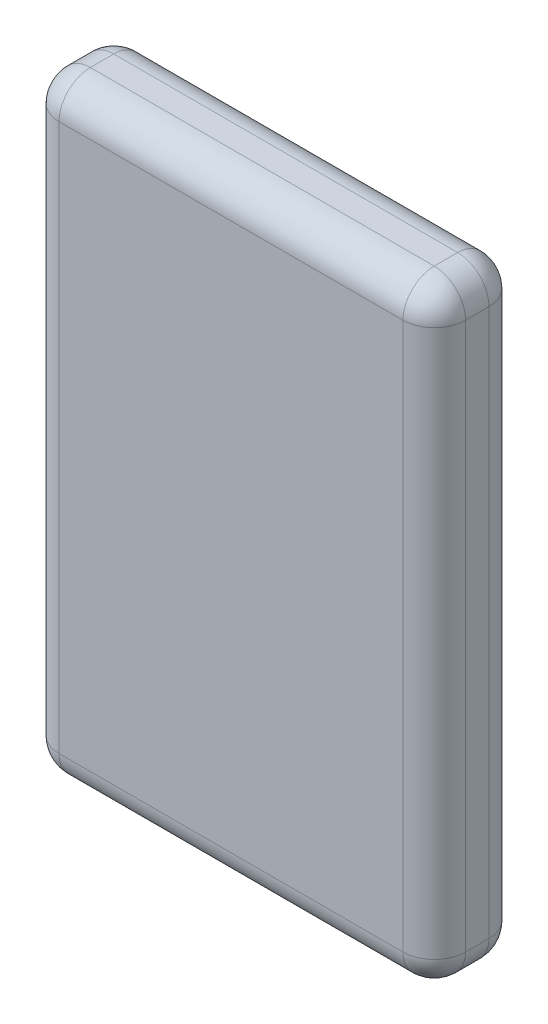
ISO-10303-21;
HEADER;
FILE_DESCRIPTION(('STEP AP214'),'2;1');
FILE_NAME('part.step','',(''),(''),'','','');
FILE_SCHEMA(('AUTOMOTIVE_DESIGN { 1 0 10303 214 1 1 1 1 }'));
ENDSEC;
DATA;
#1=APPLICATION_CONTEXT('core data for automotive mechanical design processes');
#2=APPLICATION_PROTOCOL_DEFINITION('international standard','automotive_design',2000,#1);
#3=PRODUCT_CONTEXT('',#1,'mechanical');
#4=PRODUCT('Part','Part','',(#3));
#5=PRODUCT_RELATED_PRODUCT_CATEGORY('part','',(#4));
#6=PRODUCT_DEFINITION_FORMATION('','',#4);
#7=PRODUCT_DEFINITION_CONTEXT('part definition',#1,'design');
#8=PRODUCT_DEFINITION('design','',#6,#7);
#9=PRODUCT_DEFINITION_SHAPE('','',#8);
#10=(LENGTH_UNIT() NAMED_UNIT(*) SI_UNIT(.MILLI.,.METRE.));
#11=(NAMED_UNIT(*) PLANE_ANGLE_UNIT() SI_UNIT($,.RADIAN.));
#12=(NAMED_UNIT(*) SI_UNIT($,.STERADIAN.) SOLID_ANGLE_UNIT());
#13=UNCERTAINTY_MEASURE_WITH_UNIT(LENGTH_MEASURE(1.E-05),#10,'distance_accuracy_value','');
#14=(GEOMETRIC_REPRESENTATION_CONTEXT(3) GLOBAL_UNCERTAINTY_ASSIGNED_CONTEXT((#13)) GLOBAL_UNIT_ASSIGNED_CONTEXT((#10,
#11,#12)) REPRESENTATION_CONTEXT('',''));
#15=CARTESIAN_POINT('',(0.,0.,0.));
#16=DIRECTION('',(0.,0.,1.));
#17=DIRECTION('',(1.,0.,0.));
#18=AXIS2_PLACEMENT_3D('',#15,#16,#17);
#19=CARTESIAN_POINT('',(13.,21.7257836954812,7.7));
#20=DIRECTION('',(-1.,0.,0.));
#21=DIRECTION('',(0.,-1.,0.));
#22=AXIS2_PLACEMENT_3D('',#19,#20,#21);
#23=PLANE('',#22);
#24=DIRECTION('',(0.,1.,0.));
#25=VECTOR('',#24,1.);
#26=CARTESIAN_POINT('',(13.,-17.2742163045188,5.7));
#27=LINE('',#26,#25);
#28=CARTESIAN_POINT('',(13.,19.7257836954812,5.7));
#29=VERTEX_POINT('',#28);
#30=CARTESIAN_POINT('',(13.,-15.2742163045188,5.7));
#31=VERTEX_POINT('',#30);
#32=EDGE_CURVE('E152',#29,#31,#27,.F.);
#33=ORIENTED_EDGE('',*,*,#32,.T.);
#34=DIRECTION('',(0.,0.,-1.));
#35=VECTOR('',#34,1.);
#36=CARTESIAN_POINT('',(13.,-15.2742163045188,7.7));
#37=LINE('',#36,#35);
#38=CARTESIAN_POINT('',(13.,-15.2742163045188,4.2));
#39=VERTEX_POINT('',#38);
#40=EDGE_CURVE('E126',#31,#39,#37,.T.);
#41=ORIENTED_EDGE('',*,*,#40,.T.);
#42=DIRECTION('',(0.,1.,0.));
#43=VECTOR('',#42,1.);
#44=CARTESIAN_POINT('',(13.,21.7257836954812,4.2));
#45=LINE('',#44,#43);
#46=CARTESIAN_POINT('',(13.,19.7257836954812,4.2));
#47=VERTEX_POINT('',#46);
#48=EDGE_CURVE('E143',#39,#47,#45,.T.);
#49=ORIENTED_EDGE('',*,*,#48,.T.);
#50=DIRECTION('',(0.,0.,-1.));
#51=VECTOR('',#50,1.);
#52=CARTESIAN_POINT('',(13.,19.7257836954812,7.7));
#53=LINE('',#52,#51);
#54=EDGE_CURVE('E149',#47,#29,#53,.F.);
#55=ORIENTED_EDGE('',*,*,#54,.T.);
#56=EDGE_LOOP('',(#33,#41,#49,#55));
#57=FACE_BOUND('',#56,.T.);
#58=ADVANCED_FACE('F33',(#57),#23,.F.);
#59=CARTESIAN_POINT('',(-13.,21.7257836954812,7.7));
#60=DIRECTION('',(0.,-1.,0.));
#61=DIRECTION('',(0.,0.,-1.));
#62=AXIS2_PLACEMENT_3D('',#59,#60,#61);
#63=PLANE('',#62);
#64=DIRECTION('',(-1.,0.,0.));
#65=VECTOR('',#64,1.);
#66=CARTESIAN_POINT('',(13.,21.7257836954812,5.7));
#67=LINE('',#66,#65);
#68=CARTESIAN_POINT('',(-11.,21.7257836954812,5.7));
#69=VERTEX_POINT('',#68);
#70=CARTESIAN_POINT('',(11.,21.7257836954812,5.7));
#71=VERTEX_POINT('',#70);
#72=EDGE_CURVE('E187',#69,#71,#67,.F.);
#73=ORIENTED_EDGE('',*,*,#72,.T.);
#74=DIRECTION('',(0.,0.,-1.));
#75=VECTOR('',#74,1.);
#76=CARTESIAN_POINT('',(11.,21.7257836954812,7.7));
#77=LINE('',#76,#75);
#78=CARTESIAN_POINT('',(11.,21.7257836954812,4.2));
#79=VERTEX_POINT('',#78);
#80=EDGE_CURVE('E189',#71,#79,#77,.T.);
#81=ORIENTED_EDGE('',*,*,#80,.T.);
#82=DIRECTION('',(-1.,0.,0.));
#83=VECTOR('',#82,1.);
#84=CARTESIAN_POINT('',(-13.,21.7257836954812,4.2));
#85=LINE('',#84,#83);
#86=CARTESIAN_POINT('',(-11.,21.7257836954812,4.2));
#87=VERTEX_POINT('',#86);
#88=EDGE_CURVE('E183',#79,#87,#85,.T.);
#89=ORIENTED_EDGE('',*,*,#88,.T.);
#90=DIRECTION('',(0.,0.,-1.));
#91=VECTOR('',#90,1.);
#92=CARTESIAN_POINT('',(-11.,21.7257836954812,7.7));
#93=LINE('',#92,#91);
#94=EDGE_CURVE('E185',#87,#69,#93,.F.);
#95=ORIENTED_EDGE('',*,*,#94,.T.);
#96=EDGE_LOOP('',(#73,#81,#89,#95));
#97=FACE_BOUND('',#96,.T.);
#98=ADVANCED_FACE('F291',(#97),#63,.F.);
#99=CARTESIAN_POINT('',(-13.,21.7257836954812,7.7));
#100=DIRECTION('',(1.,0.,0.));
#101=DIRECTION('',(0.,1.,0.));
#102=AXIS2_PLACEMENT_3D('',#99,#100,#101);
#103=PLANE('',#102);
#104=DIRECTION('',(0.,0.,-1.));
#105=VECTOR('',#104,1.);
#106=CARTESIAN_POINT('',(-13.,-15.2742163045188,7.7));
#107=LINE('',#106,#105);
#108=CARTESIAN_POINT('',(-13.,-15.2742163045188,4.2));
#109=VERTEX_POINT('',#108);
#110=CARTESIAN_POINT('',(-13.,-15.2742163045188,5.7));
#111=VERTEX_POINT('',#110);
#112=EDGE_CURVE('E178',#109,#111,#107,.F.);
#113=ORIENTED_EDGE('',*,*,#112,.T.);
#114=DIRECTION('',(0.,-1.,0.));
#115=VECTOR('',#114,1.);
#116=CARTESIAN_POINT('',(-13.,21.7257836954812,5.7));
#117=LINE('',#116,#115);
#118=CARTESIAN_POINT('',(-13.,19.7257836954812,5.7));
#119=VERTEX_POINT('',#118);
#120=EDGE_CURVE('E180',#111,#119,#117,.F.);
#121=ORIENTED_EDGE('',*,*,#120,.T.);
#122=DIRECTION('',(0.,0.,-1.));
#123=VECTOR('',#122,1.);
#124=CARTESIAN_POINT('',(-13.,19.7257836954812,7.7));
#125=LINE('',#124,#123);
#126=CARTESIAN_POINT('',(-13.,19.7257836954812,4.2));
#127=VERTEX_POINT('',#126);
#128=EDGE_CURVE('E176',#119,#127,#125,.T.);
#129=ORIENTED_EDGE('',*,*,#128,.T.);
#130=DIRECTION('',(0.,-1.,0.));
#131=VECTOR('',#130,1.);
#132=CARTESIAN_POINT('',(-13.,21.7257836954812,4.2));
#133=LINE('',#132,#131);
#134=EDGE_CURVE('E174',#127,#109,#133,.T.);
#135=ORIENTED_EDGE('',*,*,#134,.T.);
#136=EDGE_LOOP('',(#113,#121,#129,#135));
#137=FACE_BOUND('',#136,.T.);
#138=ADVANCED_FACE('F263',(#137),#103,.F.);
#139=CARTESIAN_POINT('',(-13.,-17.2742163045188,7.7));
#140=DIRECTION('',(0.,1.,0.));
#141=DIRECTION('',(0.,0.,1.));
#142=AXIS2_PLACEMENT_3D('',#139,#140,#141);
#143=PLANE('',#142);
#144=DIRECTION('',(1.,0.,0.));
#145=VECTOR('',#144,1.);
#146=CARTESIAN_POINT('',(-13.,-17.2742163045188,4.2));
#147=LINE('',#146,#145);
#148=CARTESIAN_POINT('',(-11.,-17.2742163045188,4.2));
#149=VERTEX_POINT('',#148);
#150=CARTESIAN_POINT('',(11.,-17.2742163045188,4.2));
#151=VERTEX_POINT('',#150);
#152=EDGE_CURVE('E154',#149,#151,#147,.T.);
#153=ORIENTED_EDGE('',*,*,#152,.T.);
#154=DIRECTION('',(0.,0.,-1.));
#155=VECTOR('',#154,1.);
#156=CARTESIAN_POINT('',(11.,-17.2742163045188,7.7));
#157=LINE('',#156,#155);
#158=CARTESIAN_POINT('',(11.,-17.2742163045188,5.7));
#159=VERTEX_POINT('',#158);
#160=EDGE_CURVE('E128',#151,#159,#157,.F.);
#161=ORIENTED_EDGE('',*,*,#160,.T.);
#162=DIRECTION('',(1.,0.,0.));
#163=VECTOR('',#162,1.);
#164=CARTESIAN_POINT('',(-13.,-17.2742163045188,5.7));
#165=LINE('',#164,#163);
#166=CARTESIAN_POINT('',(-11.,-17.2742163045188,5.7));
#167=VERTEX_POINT('',#166);
#168=EDGE_CURVE('E162',#159,#167,#165,.F.);
#169=ORIENTED_EDGE('',*,*,#168,.T.);
#170=DIRECTION('',(0.,0.,-1.));
#171=VECTOR('',#170,1.);
#172=CARTESIAN_POINT('',(-11.,-17.2742163045188,7.7));
#173=LINE('',#172,#171);
#174=EDGE_CURVE('E156',#167,#149,#173,.T.);
#175=ORIENTED_EDGE('',*,*,#174,.T.);
#176=EDGE_LOOP('',(#153,#161,#169,#175));
#177=FACE_BOUND('',#176,.T.);
#178=ADVANCED_FACE('F314',(#177),#143,.F.);
#179=CARTESIAN_POINT('',(0.,0.,7.7));
#180=DIRECTION('',(0.,0.,1.));
#181=DIRECTION('',(1.,0.,0.));
#182=AXIS2_PLACEMENT_3D('',#179,#180,#181);
#183=PLANE('',#182);
#184=DIRECTION('',(0.,-1.,0.));
#185=VECTOR('',#184,1.);
#186=CARTESIAN_POINT('',(-11.,-17.2742163045188,7.7));
#187=LINE('',#186,#185);
#188=CARTESIAN_POINT('',(-11.,19.7257836954812,7.7));
#189=VERTEX_POINT('',#188);
#190=CARTESIAN_POINT('',(-11.,-15.2742163045188,7.7));
#191=VERTEX_POINT('',#190);
#192=EDGE_CURVE('E167',#189,#191,#187,.T.);
#193=ORIENTED_EDGE('',*,*,#192,.T.);
#194=DIRECTION('',(1.,0.,0.));
#195=VECTOR('',#194,1.);
#196=CARTESIAN_POINT('',(13.,-15.2742163045188,7.7));
#197=LINE('',#196,#195);
#198=CARTESIAN_POINT('',(11.,-15.2742163045188,7.7));
#199=VERTEX_POINT('',#198);
#200=EDGE_CURVE('E171',#191,#199,#197,.T.);
#201=ORIENTED_EDGE('',*,*,#200,.T.);
#202=DIRECTION('',(0.,1.,0.));
#203=VECTOR('',#202,1.);
#204=CARTESIAN_POINT('',(11.,21.7257836954812,7.7));
#205=LINE('',#204,#203);
#206=CARTESIAN_POINT('',(11.,19.7257836954812,7.7));
#207=VERTEX_POINT('',#206);
#208=EDGE_CURVE('E169',#199,#207,#205,.T.);
#209=ORIENTED_EDGE('',*,*,#208,.T.);
#210=DIRECTION('',(-1.,0.,0.));
#211=VECTOR('',#210,1.);
#212=CARTESIAN_POINT('',(-13.,19.7257836954812,7.7));
#213=LINE('',#212,#211);
#214=EDGE_CURVE('E165',#207,#189,#213,.T.);
#215=ORIENTED_EDGE('',*,*,#214,.T.);
#216=EDGE_LOOP('',(#193,#201,#209,#215));
#217=FACE_BOUND('',#216,.T.);
#218=ADVANCED_FACE('F284',(#217),#183,.T.);
#219=CARTESIAN_POINT('',(0.,0.,2.2));
#220=DIRECTION('',(0.,0.,1.));
#221=DIRECTION('',(1.,0.,0.));
#222=AXIS2_PLACEMENT_3D('',#219,#220,#221);
#223=PLANE('',#222);
#224=DIRECTION('',(0.,-1.,0.));
#225=VECTOR('',#224,1.);
#226=CARTESIAN_POINT('',(-11.,0.,2.2));
#227=LINE('',#226,#225);
#228=CARTESIAN_POINT('',(-11.,-15.2742163045188,2.2));
#229=VERTEX_POINT('',#228);
#230=CARTESIAN_POINT('',(-11.,19.7257836954812,2.2));
#231=VERTEX_POINT('',#230);
#232=EDGE_CURVE('E42',#229,#231,#227,.F.);
#233=ORIENTED_EDGE('',*,*,#232,.T.);
#234=DIRECTION('',(-1.,0.,0.));
#235=VECTOR('',#234,1.);
#236=CARTESIAN_POINT('',(0.,19.7257836954812,2.2));
#237=LINE('',#236,#235);
#238=CARTESIAN_POINT('',(11.,19.7257836954812,2.2));
#239=VERTEX_POINT('',#238);
#240=EDGE_CURVE('E11',#231,#239,#237,.F.);
#241=ORIENTED_EDGE('',*,*,#240,.T.);
#242=DIRECTION('',(0.,1.,0.));
#243=VECTOR('',#242,1.);
#244=CARTESIAN_POINT('',(11.,0.,2.2));
#245=LINE('',#244,#243);
#246=CARTESIAN_POINT('',(11.,-15.2742163045188,2.2));
#247=VERTEX_POINT('',#246);
#248=EDGE_CURVE('E192',#239,#247,#245,.F.);
#249=ORIENTED_EDGE('',*,*,#248,.T.);
#250=DIRECTION('',(1.,0.,0.));
#251=VECTOR('',#250,1.);
#252=CARTESIAN_POINT('',(0.,-15.2742163045188,2.2));
#253=LINE('',#252,#251);
#254=EDGE_CURVE('E53',#247,#229,#253,.F.);
#255=ORIENTED_EDGE('',*,*,#254,.T.);
#256=EDGE_LOOP('',(#233,#241,#249,#255));
#257=FACE_BOUND('',#256,.T.);
#258=ADVANCED_FACE('F321',(#257),#223,.F.);
#259=CARTESIAN_POINT('',(-11.,19.7257836954812,7.7));
#260=DIRECTION('',(0.,0.,-1.));
#261=DIRECTION('',(-1.,0.,0.));
#262=AXIS2_PLACEMENT_3D('',#259,#260,#261);
#263=CYLINDRICAL_SURFACE('',#262,2.);
#264=CARTESIAN_POINT('',(-11.,19.7257836954812,5.7));
#265=DIRECTION('',(0.,0.,1.));
#266=DIRECTION('',(1.,0.,0.));
#267=AXIS2_PLACEMENT_3D('',#264,#265,#266);
#268=CIRCLE('',#267,2.);
#269=EDGE_CURVE('E37',#69,#119,#268,.T.);
#270=ORIENTED_EDGE('',*,*,#269,.F.);
#271=ORIENTED_EDGE('',*,*,#94,.F.);
#272=CARTESIAN_POINT('',(-11.,19.7257836954812,4.2));
#273=DIRECTION('',(0.,0.,-1.));
#274=DIRECTION('',(-1.,0.,0.));
#275=AXIS2_PLACEMENT_3D('',#272,#273,#274);
#276=CIRCLE('',#275,2.);
#277=EDGE_CURVE('E244',#127,#87,#276,.T.);
#278=ORIENTED_EDGE('',*,*,#277,.F.);
#279=ORIENTED_EDGE('',*,*,#128,.F.);
#280=EDGE_LOOP('',(#270,#271,#278,#279));
#281=FACE_BOUND('',#280,.T.);
#282=ADVANCED_FACE('F35',(#281),#263,.T.);
#283=CARTESIAN_POINT('',(-11.,19.7257836954812,5.7));
#284=DIRECTION('',(-1.,0.,0.));
#285=DIRECTION('',(0.,0.,1.));
#286=AXIS2_PLACEMENT_3D('',#283,#284,#285);
#287=SPHERICAL_SURFACE('',#286,2.);
#288=CARTESIAN_POINT('',(-11.,19.7257836954812,5.7));
#289=DIRECTION('',(-1.,0.,0.));
#290=DIRECTION('',(0.,0.,1.));
#291=AXIS2_PLACEMENT_3D('',#288,#289,#290);
#292=CIRCLE('',#291,2.);
#293=EDGE_CURVE('E240',#69,#189,#292,.F.);
#294=ORIENTED_EDGE('',*,*,#293,.F.);
#295=ORIENTED_EDGE('',*,*,#269,.T.);
#296=CARTESIAN_POINT('',(-11.,19.7257836954812,5.7));
#297=DIRECTION('',(0.,1.,0.));
#298=DIRECTION('',(0.,0.,1.));
#299=AXIS2_PLACEMENT_3D('',#296,#297,#298);
#300=CIRCLE('',#299,2.);
#301=EDGE_CURVE('E243',#189,#119,#300,.F.);
#302=ORIENTED_EDGE('',*,*,#301,.F.);
#303=EDGE_LOOP('',(#294,#295,#302));
#304=FACE_BOUND('',#303,.T.);
#305=ADVANCED_FACE('F256',(#304),#287,.T.);
#306=CARTESIAN_POINT('',(-11.,19.7257836954812,4.2));
#307=DIRECTION('',(0.,1.,0.));
#308=DIRECTION('',(0.,0.,1.));
#309=AXIS2_PLACEMENT_3D('',#306,#307,#308);
#310=SPHERICAL_SURFACE('',#309,2.);
#311=CARTESIAN_POINT('',(-11.,19.7257836954812,4.2));
#312=DIRECTION('',(0.,1.,0.));
#313=DIRECTION('',(0.,0.,1.));
#314=AXIS2_PLACEMENT_3D('',#311,#312,#313);
#315=CIRCLE('',#314,2.);
#316=EDGE_CURVE('E235',#127,#231,#315,.F.);
#317=ORIENTED_EDGE('',*,*,#316,.F.);
#318=ORIENTED_EDGE('',*,*,#277,.T.);
#319=CARTESIAN_POINT('',(-11.,19.7257836954812,4.2));
#320=DIRECTION('',(-1.,0.,0.));
#321=DIRECTION('',(0.,0.,1.));
#322=AXIS2_PLACEMENT_3D('',#319,#320,#321);
#323=CIRCLE('',#322,2.);
#324=EDGE_CURVE('E237',#231,#87,#323,.F.);
#325=ORIENTED_EDGE('',*,*,#324,.F.);
#326=EDGE_LOOP('',(#317,#318,#325));
#327=FACE_BOUND('',#326,.T.);
#328=ADVANCED_FACE('F303',(#327),#310,.T.);
#329=CARTESIAN_POINT('',(-11.,0.,5.7));
#330=DIRECTION('',(0.,1.,0.));
#331=DIRECTION('',(-1.,0.,0.));
#332=AXIS2_PLACEMENT_3D('',#329,#330,#331);
#333=CYLINDRICAL_SURFACE('',#332,2.);
#334=ORIENTED_EDGE('',*,*,#301,.T.);
#335=ORIENTED_EDGE('',*,*,#120,.F.);
#336=CARTESIAN_POINT('',(-11.,-15.2742163045188,5.7));
#337=DIRECTION('',(0.,-1.,0.));
#338=DIRECTION('',(0.,0.,-1.));
#339=AXIS2_PLACEMENT_3D('',#336,#337,#338);
#340=CIRCLE('',#339,2.);
#341=EDGE_CURVE('E229',#191,#111,#340,.T.);
#342=ORIENTED_EDGE('',*,*,#341,.F.);
#343=ORIENTED_EDGE('',*,*,#192,.F.);
#344=EDGE_LOOP('',(#334,#335,#342,#343));
#345=FACE_BOUND('',#344,.T.);
#346=ADVANCED_FACE('F268',(#345),#333,.T.);
#347=CARTESIAN_POINT('',(0.,19.7257836954812,5.7));
#348=DIRECTION('',(1.,0.,0.));
#349=DIRECTION('',(0.,0.,-1.));
#350=AXIS2_PLACEMENT_3D('',#347,#348,#349);
#351=CYLINDRICAL_SURFACE('',#350,2.);
#352=ORIENTED_EDGE('',*,*,#293,.T.);
#353=ORIENTED_EDGE('',*,*,#214,.F.);
#354=CARTESIAN_POINT('',(11.,19.7257836954812,5.7));
#355=DIRECTION('',(1.,0.,0.));
#356=DIRECTION('',(0.,0.,-1.));
#357=AXIS2_PLACEMENT_3D('',#354,#355,#356);
#358=CIRCLE('',#357,2.);
#359=EDGE_CURVE('E226',#71,#207,#358,.T.);
#360=ORIENTED_EDGE('',*,*,#359,.F.);
#361=ORIENTED_EDGE('',*,*,#72,.F.);
#362=EDGE_LOOP('',(#352,#353,#360,#361));
#363=FACE_BOUND('',#362,.T.);
#364=ADVANCED_FACE('F288',(#363),#351,.T.);
#365=CARTESIAN_POINT('',(11.,19.7257836954812,7.7));
#366=DIRECTION('',(0.,0.,-1.));
#367=DIRECTION('',(-1.,0.,0.));
#368=AXIS2_PLACEMENT_3D('',#365,#366,#367);
#369=CYLINDRICAL_SURFACE('',#368,2.);
#370=CARTESIAN_POINT('',(11.,19.7257836954812,4.2));
#371=DIRECTION('',(0.,0.,-1.));
#372=DIRECTION('',(-1.,0.,0.));
#373=AXIS2_PLACEMENT_3D('',#370,#371,#372);
#374=CIRCLE('',#373,2.);
#375=EDGE_CURVE('E220',#79,#47,#374,.T.);
#376=ORIENTED_EDGE('',*,*,#375,.F.);
#377=ORIENTED_EDGE('',*,*,#80,.F.);
#378=CARTESIAN_POINT('',(11.,19.7257836954812,5.7));
#379=DIRECTION('',(0.,0.,1.));
#380=DIRECTION('',(1.,0.,0.));
#381=AXIS2_PLACEMENT_3D('',#378,#379,#380);
#382=CIRCLE('',#381,2.);
#383=EDGE_CURVE('E223',#29,#71,#382,.T.);
#384=ORIENTED_EDGE('',*,*,#383,.F.);
#385=ORIENTED_EDGE('',*,*,#54,.F.);
#386=EDGE_LOOP('',(#376,#377,#384,#385));
#387=FACE_BOUND('',#386,.T.);
#388=ADVANCED_FACE('F295',(#387),#369,.T.);
#389=CARTESIAN_POINT('',(-13.,19.7257836954812,4.2));
#390=DIRECTION('',(-1.,0.,0.));
#391=DIRECTION('',(0.,0.,1.));
#392=AXIS2_PLACEMENT_3D('',#389,#390,#391);
#393=CYLINDRICAL_SURFACE('',#392,2.);
#394=ORIENTED_EDGE('',*,*,#324,.T.);
#395=ORIENTED_EDGE('',*,*,#88,.F.);
#396=CARTESIAN_POINT('',(11.,19.7257836954812,4.2));
#397=DIRECTION('',(1.,0.,0.));
#398=DIRECTION('',(0.,1.,0.));
#399=AXIS2_PLACEMENT_3D('',#396,#397,#398);
#400=CIRCLE('',#399,2.);
#401=EDGE_CURVE('E218',#239,#79,#400,.T.);
#402=ORIENTED_EDGE('',*,*,#401,.F.);
#403=ORIENTED_EDGE('',*,*,#240,.F.);
#404=EDGE_LOOP('',(#394,#395,#402,#403));
#405=FACE_BOUND('',#404,.T.);
#406=ADVANCED_FACE('F301',(#405),#393,.T.);
#407=CARTESIAN_POINT('',(-11.,21.7257836954812,4.2));
#408=DIRECTION('',(0.,-1.,0.));
#409=DIRECTION('',(1.,0.,0.));
#410=AXIS2_PLACEMENT_3D('',#407,#408,#409);
#411=CYLINDRICAL_SURFACE('',#410,2.);
#412=ORIENTED_EDGE('',*,*,#316,.T.);
#413=ORIENTED_EDGE('',*,*,#232,.F.);
#414=CARTESIAN_POINT('',(-11.,-15.2742163045188,4.2));
#415=DIRECTION('',(0.,-1.,0.));
#416=DIRECTION('',(0.,0.,-1.));
#417=AXIS2_PLACEMENT_3D('',#414,#415,#416);
#418=CIRCLE('',#417,2.);
#419=EDGE_CURVE('E215',#109,#229,#418,.T.);
#420=ORIENTED_EDGE('',*,*,#419,.F.);
#421=ORIENTED_EDGE('',*,*,#134,.F.);
#422=EDGE_LOOP('',(#412,#413,#420,#421));
#423=FACE_BOUND('',#422,.T.);
#424=ADVANCED_FACE('F306',(#423),#411,.T.);
#425=CARTESIAN_POINT('',(-11.,-15.2742163045188,7.7));
#426=DIRECTION('',(0.,0.,-1.));
#427=DIRECTION('',(-1.,0.,0.));
#428=AXIS2_PLACEMENT_3D('',#425,#426,#427);
#429=CYLINDRICAL_SURFACE('',#428,2.);
#430=CARTESIAN_POINT('',(-11.,-15.2742163045188,5.7));
#431=DIRECTION('',(0.,0.,1.));
#432=DIRECTION('',(1.,0.,0.));
#433=AXIS2_PLACEMENT_3D('',#430,#431,#432);
#434=CIRCLE('',#433,2.);
#435=EDGE_CURVE('E232',#111,#167,#434,.T.);
#436=ORIENTED_EDGE('',*,*,#435,.F.);
#437=ORIENTED_EDGE('',*,*,#112,.F.);
#438=CARTESIAN_POINT('',(-11.,-15.2742163045188,4.2));
#439=DIRECTION('',(0.,0.,-1.));
#440=DIRECTION('',(-1.,0.,0.));
#441=AXIS2_PLACEMENT_3D('',#438,#439,#440);
#442=CIRCLE('',#441,2.);
#443=EDGE_CURVE('E212',#149,#109,#442,.T.);
#444=ORIENTED_EDGE('',*,*,#443,.F.);
#445=ORIENTED_EDGE('',*,*,#174,.F.);
#446=EDGE_LOOP('',(#436,#437,#444,#445));
#447=FACE_BOUND('',#446,.T.);
#448=ADVANCED_FACE('F272',(#447),#429,.T.);
#449=CARTESIAN_POINT('',(-11.,-15.2742163045188,5.7));
#450=DIRECTION('',(-1.,0.,0.));
#451=DIRECTION('',(0.,0.,1.));
#452=AXIS2_PLACEMENT_3D('',#449,#450,#451);
#453=SPHERICAL_SURFACE('',#452,2.);
#454=ORIENTED_EDGE('',*,*,#341,.T.);
#455=ORIENTED_EDGE('',*,*,#435,.T.);
#456=CARTESIAN_POINT('',(-11.,-15.2742163045188,5.7));
#457=DIRECTION('',(-1.,0.,0.));
#458=DIRECTION('',(0.,0.,1.));
#459=AXIS2_PLACEMENT_3D('',#456,#457,#458);
#460=CIRCLE('',#459,2.);
#461=EDGE_CURVE('E209',#191,#167,#460,.F.);
#462=ORIENTED_EDGE('',*,*,#461,.F.);
#463=EDGE_LOOP('',(#454,#455,#462));
#464=FACE_BOUND('',#463,.T.);
#465=ADVANCED_FACE('F276',(#464),#453,.T.);
#466=CARTESIAN_POINT('',(11.,19.7257836954812,5.7));
#467=DIRECTION('',(0.,1.,0.));
#468=DIRECTION('',(-1.,0.,0.));
#469=AXIS2_PLACEMENT_3D('',#466,#467,#468);
#470=SPHERICAL_SURFACE('',#469,2.);
#471=ORIENTED_EDGE('',*,*,#383,.T.);
#472=ORIENTED_EDGE('',*,*,#359,.T.);
#473=CARTESIAN_POINT('',(11.,19.7257836954812,5.7));
#474=DIRECTION('',(0.,1.,0.));
#475=DIRECTION('',(0.,0.,1.));
#476=AXIS2_PLACEMENT_3D('',#473,#474,#475);
#477=CIRCLE('',#476,2.);
#478=EDGE_CURVE('E206',#29,#207,#477,.F.);
#479=ORIENTED_EDGE('',*,*,#478,.F.);
#480=EDGE_LOOP('',(#471,#472,#479));
#481=FACE_BOUND('',#480,.T.);
#482=ADVANCED_FACE('F355',(#481),#470,.T.);
#483=CARTESIAN_POINT('',(11.,19.7257836954812,4.2));
#484=DIRECTION('',(0.,1.,0.));
#485=DIRECTION('',(-1.,0.,0.));
#486=AXIS2_PLACEMENT_3D('',#483,#484,#485);
#487=SPHERICAL_SURFACE('',#486,2.);
#488=ORIENTED_EDGE('',*,*,#401,.T.);
#489=ORIENTED_EDGE('',*,*,#375,.T.);
#490=CARTESIAN_POINT('',(11.,19.7257836954812,4.2));
#491=DIRECTION('',(0.,1.,0.));
#492=DIRECTION('',(0.,0.,1.));
#493=AXIS2_PLACEMENT_3D('',#490,#491,#492);
#494=CIRCLE('',#493,2.);
#495=EDGE_CURVE('E146',#239,#47,#494,.F.);
#496=ORIENTED_EDGE('',*,*,#495,.F.);
#497=EDGE_LOOP('',(#488,#489,#496));
#498=FACE_BOUND('',#497,.T.);
#499=ADVANCED_FACE('F352',(#498),#487,.T.);
#500=CARTESIAN_POINT('',(-11.,-15.2742163045188,4.2));
#501=DIRECTION('',(-1.,0.,0.));
#502=DIRECTION('',(0.,0.,1.));
#503=AXIS2_PLACEMENT_3D('',#500,#501,#502);
#504=SPHERICAL_SURFACE('',#503,2.);
#505=ORIENTED_EDGE('',*,*,#443,.T.);
#506=ORIENTED_EDGE('',*,*,#419,.T.);
#507=CARTESIAN_POINT('',(-11.,-15.2742163045188,4.2));
#508=DIRECTION('',(-1.,0.,0.));
#509=DIRECTION('',(0.,0.,1.));
#510=AXIS2_PLACEMENT_3D('',#507,#508,#509);
#511=CIRCLE('',#510,2.);
#512=EDGE_CURVE('E202',#149,#229,#511,.F.);
#513=ORIENTED_EDGE('',*,*,#512,.F.);
#514=EDGE_LOOP('',(#505,#506,#513));
#515=FACE_BOUND('',#514,.T.);
#516=ADVANCED_FACE('F309',(#515),#504,.T.);
#517=CARTESIAN_POINT('',(0.,-15.2742163045188,5.7));
#518=DIRECTION('',(-1.,0.,0.));
#519=DIRECTION('',(0.,0.,1.));
#520=AXIS2_PLACEMENT_3D('',#517,#518,#519);
#521=CYLINDRICAL_SURFACE('',#520,2.);
#522=ORIENTED_EDGE('',*,*,#461,.T.);
#523=ORIENTED_EDGE('',*,*,#168,.F.);
#524=CARTESIAN_POINT('',(11.,-15.2742163045188,5.7));
#525=DIRECTION('',(1.,0.,0.));
#526=DIRECTION('',(0.,0.,-1.));
#527=AXIS2_PLACEMENT_3D('',#524,#525,#526);
#528=CIRCLE('',#527,2.);
#529=EDGE_CURVE('E199',#199,#159,#528,.T.);
#530=ORIENTED_EDGE('',*,*,#529,.F.);
#531=ORIENTED_EDGE('',*,*,#200,.F.);
#532=EDGE_LOOP('',(#522,#523,#530,#531));
#533=FACE_BOUND('',#532,.T.);
#534=ADVANCED_FACE('F281',(#533),#521,.T.);
#535=CARTESIAN_POINT('',(11.,0.,5.7));
#536=DIRECTION('',(0.,-1.,0.));
#537=DIRECTION('',(1.,0.,0.));
#538=AXIS2_PLACEMENT_3D('',#535,#536,#537);
#539=CYLINDRICAL_SURFACE('',#538,2.);
#540=ORIENTED_EDGE('',*,*,#478,.T.);
#541=ORIENTED_EDGE('',*,*,#208,.F.);
#542=CARTESIAN_POINT('',(11.,-15.2742163045188,5.7));
#543=DIRECTION('',(0.,-1.,0.));
#544=DIRECTION('',(0.,0.,-1.));
#545=AXIS2_PLACEMENT_3D('',#542,#543,#544);
#546=CIRCLE('',#545,2.);
#547=EDGE_CURVE('E140',#31,#199,#546,.T.);
#548=ORIENTED_EDGE('',*,*,#547,.F.);
#549=ORIENTED_EDGE('',*,*,#32,.F.);
#550=EDGE_LOOP('',(#540,#541,#548,#549));
#551=FACE_BOUND('',#550,.T.);
#552=ADVANCED_FACE('F344',(#551),#539,.T.);
#553=CARTESIAN_POINT('',(11.,21.7257836954812,4.2));
#554=DIRECTION('',(0.,1.,0.));
#555=DIRECTION('',(-1.,0.,0.));
#556=AXIS2_PLACEMENT_3D('',#553,#554,#555);
#557=CYLINDRICAL_SURFACE('',#556,2.);
#558=ORIENTED_EDGE('',*,*,#495,.T.);
#559=ORIENTED_EDGE('',*,*,#48,.F.);
#560=CARTESIAN_POINT('',(11.,-15.2742163045188,4.2));
#561=DIRECTION('',(0.,-1.,0.));
#562=DIRECTION('',(1.,0.,0.));
#563=AXIS2_PLACEMENT_3D('',#560,#561,#562);
#564=CIRCLE('',#563,2.);
#565=EDGE_CURVE('E134',#247,#39,#564,.T.);
#566=ORIENTED_EDGE('',*,*,#565,.F.);
#567=ORIENTED_EDGE('',*,*,#248,.F.);
#568=EDGE_LOOP('',(#558,#559,#566,#567));
#569=FACE_BOUND('',#568,.T.);
#570=ADVANCED_FACE('F144',(#569),#557,.T.);
#571=CARTESIAN_POINT('',(-13.,-15.2742163045188,4.2));
#572=DIRECTION('',(1.,0.,0.));
#573=DIRECTION('',(0.,0.,-1.));
#574=AXIS2_PLACEMENT_3D('',#571,#572,#573);
#575=CYLINDRICAL_SURFACE('',#574,2.);
#576=ORIENTED_EDGE('',*,*,#512,.T.);
#577=ORIENTED_EDGE('',*,*,#254,.F.);
#578=CARTESIAN_POINT('',(11.,-15.2742163045188,4.2));
#579=DIRECTION('',(1.,0.,0.));
#580=DIRECTION('',(0.,0.,-1.));
#581=AXIS2_PLACEMENT_3D('',#578,#579,#580);
#582=CIRCLE('',#581,2.);
#583=EDGE_CURVE('E138',#151,#247,#582,.T.);
#584=ORIENTED_EDGE('',*,*,#583,.F.);
#585=ORIENTED_EDGE('',*,*,#152,.F.);
#586=EDGE_LOOP('',(#576,#577,#584,#585));
#587=FACE_BOUND('',#586,.T.);
#588=ADVANCED_FACE('F312',(#587),#575,.T.);
#589=CARTESIAN_POINT('',(11.,-15.2742163045188,5.7));
#590=DIRECTION('',(0.,0.,1.));
#591=DIRECTION('',(1.,0.,0.));
#592=AXIS2_PLACEMENT_3D('',#589,#590,#591);
#593=SPHERICAL_SURFACE('',#592,2.);
#594=ORIENTED_EDGE('',*,*,#547,.T.);
#595=ORIENTED_EDGE('',*,*,#529,.T.);
#596=CARTESIAN_POINT('',(11.,-15.2742163045188,5.7));
#597=DIRECTION('',(0.,0.,1.));
#598=DIRECTION('',(1.,0.,0.));
#599=AXIS2_PLACEMENT_3D('',#596,#597,#598);
#600=CIRCLE('',#599,2.);
#601=EDGE_CURVE('E131',#31,#159,#600,.F.);
#602=ORIENTED_EDGE('',*,*,#601,.F.);
#603=EDGE_LOOP('',(#594,#595,#602));
#604=FACE_BOUND('',#603,.T.);
#605=ADVANCED_FACE('F336',(#604),#593,.T.);
#606=CARTESIAN_POINT('',(11.,-15.2742163045188,4.2));
#607=DIRECTION('',(0.,0.,-1.));
#608=DIRECTION('',(-1.,0.,0.));
#609=AXIS2_PLACEMENT_3D('',#606,#607,#608);
#610=SPHERICAL_SURFACE('',#609,2.);
#611=ORIENTED_EDGE('',*,*,#583,.T.);
#612=ORIENTED_EDGE('',*,*,#565,.T.);
#613=CARTESIAN_POINT('',(11.,-15.2742163045188,4.2));
#614=DIRECTION('',(0.,0.,-1.));
#615=DIRECTION('',(-1.,0.,0.));
#616=AXIS2_PLACEMENT_3D('',#613,#614,#615);
#617=CIRCLE('',#616,2.);
#618=EDGE_CURVE('E122',#151,#39,#617,.F.);
#619=ORIENTED_EDGE('',*,*,#618,.F.);
#620=EDGE_LOOP('',(#611,#612,#619));
#621=FACE_BOUND('',#620,.T.);
#622=ADVANCED_FACE('F136',(#621),#610,.T.);
#623=CARTESIAN_POINT('',(11.,-15.2742163045188,7.7));
#624=DIRECTION('',(0.,0.,-1.));
#625=DIRECTION('',(-1.,0.,0.));
#626=AXIS2_PLACEMENT_3D('',#623,#624,#625);
#627=CYLINDRICAL_SURFACE('',#626,2.);
#628=ORIENTED_EDGE('',*,*,#601,.T.);
#629=ORIENTED_EDGE('',*,*,#160,.F.);
#630=ORIENTED_EDGE('',*,*,#618,.T.);
#631=ORIENTED_EDGE('',*,*,#40,.F.);
#632=EDGE_LOOP('',(#628,#629,#630,#631));
#633=FACE_BOUND('',#632,.T.);
#634=ADVANCED_FACE('F124',(#633),#627,.T.);
#635=CLOSED_SHELL('',(#58,#98,#138,#178,#218,#258,#282,#305,#328,#346,#364,#388,#406,#424,#448,
#465,#482,#499,#516,#534,#552,#570,#588,#605,#622,#634));
#636=MANIFOLD_SOLID_BREP('B2',#635);
#637=ADVANCED_BREP_SHAPE_REPRESENTATION('',(#18,#636),#14);
#638=SHAPE_DEFINITION_REPRESENTATION(#9,#637);
ENDSEC;
END-ISO-10303-21;
